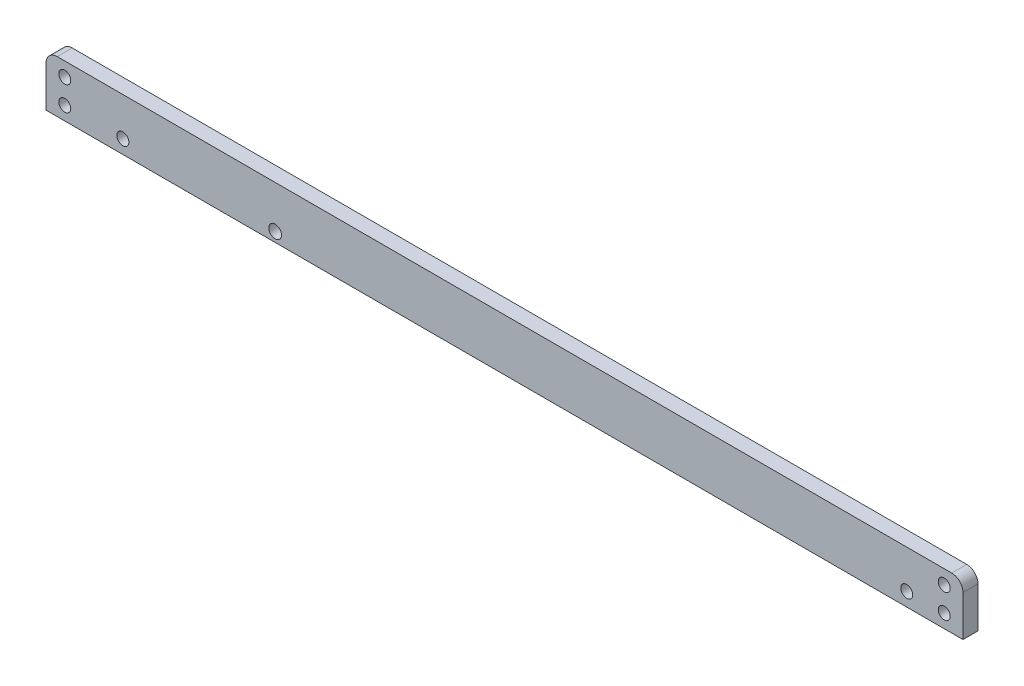
ISO-10303-21;
HEADER;
FILE_DESCRIPTION(('STEP AP214'),'2;1');
FILE_NAME('part.step','',(''),(''),'','','');
FILE_SCHEMA(('AUTOMOTIVE_DESIGN { 1 0 10303 214 1 1 1 1 }'));
ENDSEC;
DATA;
#1=APPLICATION_CONTEXT('core data for automotive mechanical design processes');
#2=APPLICATION_PROTOCOL_DEFINITION('international standard','automotive_design',2000,#1);
#3=PRODUCT_CONTEXT('',#1,'mechanical');
#4=PRODUCT('Part','Part','',(#3));
#5=PRODUCT_RELATED_PRODUCT_CATEGORY('part','',(#4));
#6=PRODUCT_DEFINITION_FORMATION('','',#4);
#7=PRODUCT_DEFINITION_CONTEXT('part definition',#1,'design');
#8=PRODUCT_DEFINITION('design','',#6,#7);
#9=PRODUCT_DEFINITION_SHAPE('','',#8);
#10=(LENGTH_UNIT() NAMED_UNIT(*) SI_UNIT(.MILLI.,.METRE.));
#11=(NAMED_UNIT(*) PLANE_ANGLE_UNIT() SI_UNIT($,.RADIAN.));
#12=(NAMED_UNIT(*) SI_UNIT($,.STERADIAN.) SOLID_ANGLE_UNIT());
#13=UNCERTAINTY_MEASURE_WITH_UNIT(LENGTH_MEASURE(1.E-05),#10,'distance_accuracy_value','');
#14=(GEOMETRIC_REPRESENTATION_CONTEXT(3) GLOBAL_UNCERTAINTY_ASSIGNED_CONTEXT((#13)) GLOBAL_UNIT_ASSIGNED_CONTEXT((#10,
#11,#12)) REPRESENTATION_CONTEXT('',''));
#15=CARTESIAN_POINT('',(0.,0.,0.));
#16=DIRECTION('',(0.,0.,1.));
#17=DIRECTION('',(1.,0.,0.));
#18=AXIS2_PLACEMENT_3D('',#15,#16,#17);
#19=CARTESIAN_POINT('',(59.5710686986753,86.4050911707322,4.));
#20=DIRECTION('',(0.,0.,-1.));
#21=DIRECTION('',(-1.,0.,0.));
#22=AXIS2_PLACEMENT_3D('',#19,#20,#21);
#23=CYLINDRICAL_SURFACE('',#22,3.);
#24=CARTESIAN_POINT('',(59.5710686986753,86.4050911707322,0.));
#25=DIRECTION('',(0.,0.,1.));
#26=DIRECTION('',(1.,0.,0.));
#27=AXIS2_PLACEMENT_3D('',#24,#25,#26);
#28=CIRCLE('',#27,3.);
#29=CARTESIAN_POINT('',(62.5710686986753,86.4050911707322,0.));
#30=VERTEX_POINT('',#29);
#31=CARTESIAN_POINT('',(59.5710686986753,89.4050911707322,0.));
#32=VERTEX_POINT('',#31);
#33=EDGE_CURVE('E116',#30,#32,#28,.T.);
#34=ORIENTED_EDGE('',*,*,#33,.T.);
#35=DIRECTION('',(0.,0.,-1.));
#36=VECTOR('',#35,1.);
#37=CARTESIAN_POINT('',(59.5710686986753,89.4050911707322,4.));
#38=LINE('',#37,#36);
#39=CARTESIAN_POINT('',(59.5710686986753,89.4050911707322,4.));
#40=VERTEX_POINT('',#39);
#41=EDGE_CURVE('E11',#40,#32,#38,.T.);
#42=ORIENTED_EDGE('',*,*,#41,.F.);
#43=CARTESIAN_POINT('',(59.5710686986753,86.4050911707322,4.));
#44=DIRECTION('',(0.,0.,1.));
#45=DIRECTION('',(1.,0.,0.));
#46=AXIS2_PLACEMENT_3D('',#43,#44,#45);
#47=CIRCLE('',#46,3.);
#48=CARTESIAN_POINT('',(62.5710686986753,86.4050911707322,4.));
#49=VERTEX_POINT('',#48);
#50=EDGE_CURVE('E127',#49,#40,#47,.T.);
#51=ORIENTED_EDGE('',*,*,#50,.F.);
#52=DIRECTION('',(0.,0.,-1.));
#53=VECTOR('',#52,1.);
#54=CARTESIAN_POINT('',(62.5710686986753,86.4050911707322,4.));
#55=LINE('',#54,#53);
#56=EDGE_CURVE('E112',#49,#30,#55,.T.);
#57=ORIENTED_EDGE('',*,*,#56,.T.);
#58=EDGE_LOOP('',(#34,#42,#51,#57));
#59=FACE_BOUND('',#58,.T.);
#60=ADVANCED_FACE('F32',(#59),#23,.T.);
#61=CARTESIAN_POINT('',(59.5710686986753,89.4050911707322,4.));
#62=DIRECTION('',(0.,-1.,0.));
#63=DIRECTION('',(1.,0.,0.));
#64=AXIS2_PLACEMENT_3D('',#61,#62,#63);
#65=PLANE('',#64);
#66=DIRECTION('',(-1.,0.,0.));
#67=VECTOR('',#66,1.);
#68=CARTESIAN_POINT('',(59.5710686986753,89.4050911707322,0.));
#69=LINE('',#68,#67);
#70=CARTESIAN_POINT('',(-178.928931301324,89.4050911707322,0.));
#71=VERTEX_POINT('',#70);
#72=EDGE_CURVE('E119',#32,#71,#69,.T.);
#73=ORIENTED_EDGE('',*,*,#72,.T.);
#74=DIRECTION('',(0.,0.,-1.));
#75=VECTOR('',#74,1.);
#76=CARTESIAN_POINT('',(-178.928931301324,89.4050911707322,4.));
#77=LINE('',#76,#75);
#78=CARTESIAN_POINT('',(-178.928931301324,89.4050911707322,4.));
#79=VERTEX_POINT('',#78);
#80=EDGE_CURVE('E40',#79,#71,#77,.T.);
#81=ORIENTED_EDGE('',*,*,#80,.F.);
#82=DIRECTION('',(-1.,0.,0.));
#83=VECTOR('',#82,1.);
#84=CARTESIAN_POINT('',(59.5710686986753,89.4050911707322,4.));
#85=LINE('',#84,#83);
#86=EDGE_CURVE('E85',#40,#79,#85,.T.);
#87=ORIENTED_EDGE('',*,*,#86,.F.);
#88=ORIENTED_EDGE('',*,*,#41,.T.);
#89=EDGE_LOOP('',(#73,#81,#87,#88));
#90=FACE_BOUND('',#89,.T.);
#91=ADVANCED_FACE('F152',(#90),#65,.F.);
#92=CARTESIAN_POINT('',(-178.928931301324,86.4050911707322,4.));
#93=DIRECTION('',(0.,0.,-1.));
#94=DIRECTION('',(-1.,0.,0.));
#95=AXIS2_PLACEMENT_3D('',#92,#93,#94);
#96=CYLINDRICAL_SURFACE('',#95,3.);
#97=CARTESIAN_POINT('',(-178.928931301324,86.4050911707322,0.));
#98=DIRECTION('',(0.,0.,1.));
#99=DIRECTION('',(1.,0.,0.));
#100=AXIS2_PLACEMENT_3D('',#97,#98,#99);
#101=CIRCLE('',#100,3.);
#102=CARTESIAN_POINT('',(-181.928931301324,86.4050911707322,0.));
#103=VERTEX_POINT('',#102);
#104=EDGE_CURVE('E122',#71,#103,#101,.T.);
#105=ORIENTED_EDGE('',*,*,#104,.T.);
#106=DIRECTION('',(0.,0.,-1.));
#107=VECTOR('',#106,1.);
#108=CARTESIAN_POINT('',(-181.928931301324,86.4050911707322,4.));
#109=LINE('',#108,#107);
#110=CARTESIAN_POINT('',(-181.928931301324,86.4050911707322,4.));
#111=VERTEX_POINT('',#110);
#112=EDGE_CURVE('E107',#111,#103,#109,.T.);
#113=ORIENTED_EDGE('',*,*,#112,.F.);
#114=CARTESIAN_POINT('',(-178.928931301324,86.4050911707322,4.));
#115=DIRECTION('',(0.,0.,1.));
#116=DIRECTION('',(1.,0.,0.));
#117=AXIS2_PLACEMENT_3D('',#114,#115,#116);
#118=CIRCLE('',#117,3.);
#119=EDGE_CURVE('E98',#79,#111,#118,.T.);
#120=ORIENTED_EDGE('',*,*,#119,.F.);
#121=ORIENTED_EDGE('',*,*,#80,.T.);
#122=EDGE_LOOP('',(#105,#113,#120,#121));
#123=FACE_BOUND('',#122,.T.);
#124=ADVANCED_FACE('F133',(#123),#96,.T.);
#125=CARTESIAN_POINT('',(-181.928931301324,86.4050911707322,4.));
#126=DIRECTION('',(1.,0.,0.));
#127=DIRECTION('',(0.,1.,0.));
#128=AXIS2_PLACEMENT_3D('',#125,#126,#127);
#129=PLANE('',#128);
#130=DIRECTION('',(0.,-1.,0.));
#131=VECTOR('',#130,1.);
#132=CARTESIAN_POINT('',(-181.928931301324,86.4050911707322,0.));
#133=LINE('',#132,#131);
#134=CARTESIAN_POINT('',(-181.928931301324,75.5392616190504,0.));
#135=VERTEX_POINT('',#134);
#136=EDGE_CURVE('E106',#103,#135,#133,.T.);
#137=ORIENTED_EDGE('',*,*,#136,.T.);
#138=DIRECTION('',(0.,0.,-1.));
#139=VECTOR('',#138,1.);
#140=CARTESIAN_POINT('',(-181.928931301324,75.5392616190504,4.));
#141=LINE('',#140,#139);
#142=CARTESIAN_POINT('',(-181.928931301324,75.5392616190504,4.));
#143=VERTEX_POINT('',#142);
#144=EDGE_CURVE('E103',#143,#135,#141,.T.);
#145=ORIENTED_EDGE('',*,*,#144,.F.);
#146=DIRECTION('',(0.,-1.,0.));
#147=VECTOR('',#146,1.);
#148=CARTESIAN_POINT('',(-181.928931301324,86.4050911707322,4.));
#149=LINE('',#148,#147);
#150=EDGE_CURVE('E92',#111,#143,#149,.T.);
#151=ORIENTED_EDGE('',*,*,#150,.F.);
#152=ORIENTED_EDGE('',*,*,#112,.T.);
#153=EDGE_LOOP('',(#137,#145,#151,#152));
#154=FACE_BOUND('',#153,.T.);
#155=ADVANCED_FACE('F104',(#154),#129,.F.);
#156=CARTESIAN_POINT('',(62.5710686986753,75.5392616190504,4.));
#157=DIRECTION('',(0.,1.,0.));
#158=DIRECTION('',(0.,0.,1.));
#159=AXIS2_PLACEMENT_3D('',#156,#157,#158);
#160=PLANE('',#159);
#161=DIRECTION('',(1.,0.,0.));
#162=VECTOR('',#161,1.);
#163=CARTESIAN_POINT('',(62.5710686986753,75.5392616190504,0.));
#164=LINE('',#163,#162);
#165=CARTESIAN_POINT('',(62.5710686986753,75.5392616190504,0.));
#166=VERTEX_POINT('',#165);
#167=EDGE_CURVE('E71',#135,#166,#164,.T.);
#168=ORIENTED_EDGE('',*,*,#167,.T.);
#169=DIRECTION('',(0.,0.,-1.));
#170=VECTOR('',#169,1.);
#171=CARTESIAN_POINT('',(62.5710686986753,75.5392616190504,4.));
#172=LINE('',#171,#170);
#173=CARTESIAN_POINT('',(62.5710686986753,75.5392616190504,4.));
#174=VERTEX_POINT('',#173);
#175=EDGE_CURVE('E108',#174,#166,#172,.T.);
#176=ORIENTED_EDGE('',*,*,#175,.F.);
#177=DIRECTION('',(1.,0.,0.));
#178=VECTOR('',#177,1.);
#179=CARTESIAN_POINT('',(62.5710686986753,75.5392616190504,4.));
#180=LINE('',#179,#178);
#181=EDGE_CURVE('E96',#143,#174,#180,.T.);
#182=ORIENTED_EDGE('',*,*,#181,.F.);
#183=ORIENTED_EDGE('',*,*,#144,.T.);
#184=EDGE_LOOP('',(#168,#176,#182,#183));
#185=FACE_BOUND('',#184,.T.);
#186=ADVANCED_FACE('F110',(#185),#160,.F.);
#187=CARTESIAN_POINT('',(62.5710686986753,75.5392616190504,4.));
#188=DIRECTION('',(-1.,0.,0.));
#189=DIRECTION('',(0.,0.,1.));
#190=AXIS2_PLACEMENT_3D('',#187,#188,#189);
#191=PLANE('',#190);
#192=DIRECTION('',(0.,1.,0.));
#193=VECTOR('',#192,1.);
#194=CARTESIAN_POINT('',(62.5710686986753,75.5392616190504,0.));
#195=LINE('',#194,#193);
#196=EDGE_CURVE('E77',#166,#30,#195,.T.);
#197=ORIENTED_EDGE('',*,*,#196,.T.);
#198=ORIENTED_EDGE('',*,*,#56,.F.);
#199=DIRECTION('',(0.,1.,0.));
#200=VECTOR('',#199,1.);
#201=CARTESIAN_POINT('',(62.5710686986753,75.5392616190504,4.));
#202=LINE('',#201,#200);
#203=EDGE_CURVE('E48',#174,#49,#202,.T.);
#204=ORIENTED_EDGE('',*,*,#203,.F.);
#205=ORIENTED_EDGE('',*,*,#175,.T.);
#206=EDGE_LOOP('',(#197,#198,#204,#205));
#207=FACE_BOUND('',#206,.T.);
#208=ADVANCED_FACE('F140',(#207),#191,.F.);
#209=CARTESIAN_POINT('',(59.5710686986753,86.4050911707322,4.));
#210=DIRECTION('',(0.,0.,1.));
#211=DIRECTION('',(1.,0.,0.));
#212=AXIS2_PLACEMENT_3D('',#209,#210,#211);
#213=PLANE('',#212);
#214=CARTESIAN_POINT('',(-120.832295199773,78.0750911707318,4.));
#215=DIRECTION('',(0.,0.,-1.));
#216=DIRECTION('',(-1.,0.,0.));
#217=AXIS2_PLACEMENT_3D('',#214,#215,#216);
#218=CIRCLE('',#217,1.69999999999999);
#219=CARTESIAN_POINT('',(-122.532295199773,78.0750911707318,4.));
#220=VERTEX_POINT('',#219);
#221=EDGE_CURVE('E265',#220,#220,#218,.T.);
#222=ORIENTED_EDGE('',*,*,#221,.T.);
#223=EDGE_LOOP('',(#222));
#224=FACE_BOUND('',#223,.T.);
#225=CARTESIAN_POINT('',(-176.928931301324,85.6728411707414,4.));
#226=DIRECTION('',(0.,0.,1.));
#227=DIRECTION('',(1.,0.,0.));
#228=AXIS2_PLACEMENT_3D('',#225,#226,#227);
#229=CIRCLE('',#228,1.59999999999999);
#230=CARTESIAN_POINT('',(-175.328931301324,85.6728411707414,4.));
#231=VERTEX_POINT('',#230);
#232=EDGE_CURVE('E270',#231,#231,#229,.T.);
#233=ORIENTED_EDGE('',*,*,#232,.F.);
#234=EDGE_LOOP('',(#233));
#235=FACE_BOUND('',#234,.T.);
#236=CARTESIAN_POINT('',(-176.928931301324,79.1728411707414,4.));
#237=DIRECTION('',(0.,0.,1.));
#238=DIRECTION('',(1.,0.,0.));
#239=AXIS2_PLACEMENT_3D('',#236,#237,#238);
#240=CIRCLE('',#239,1.59999999999999);
#241=CARTESIAN_POINT('',(-175.328931301324,79.1728411707414,4.));
#242=VERTEX_POINT('',#241);
#243=EDGE_CURVE('E278',#242,#242,#240,.T.);
#244=ORIENTED_EDGE('',*,*,#243,.F.);
#245=EDGE_LOOP('',(#244));
#246=FACE_BOUND('',#245,.T.);
#247=CARTESIAN_POINT('',(-161.428931301324,79.1728411707414,4.));
#248=DIRECTION('',(0.,0.,1.));
#249=DIRECTION('',(1.,0.,0.));
#250=AXIS2_PLACEMENT_3D('',#247,#248,#249);
#251=CIRCLE('',#250,1.59999999999999);
#252=CARTESIAN_POINT('',(-159.828931301324,79.1728411707414,4.));
#253=VERTEX_POINT('',#252);
#254=EDGE_CURVE('E284',#253,#253,#251,.T.);
#255=ORIENTED_EDGE('',*,*,#254,.F.);
#256=EDGE_LOOP('',(#255));
#257=FACE_BOUND('',#256,.T.);
#258=CARTESIAN_POINT('',(47.5710686986759,79.1728411707414,4.));
#259=DIRECTION('',(0.,0.,1.));
#260=DIRECTION('',(1.,0.,0.));
#261=AXIS2_PLACEMENT_3D('',#258,#259,#260);
#262=CIRCLE('',#261,1.59999999999999);
#263=CARTESIAN_POINT('',(49.1710686986759,79.1728411707414,4.));
#264=VERTEX_POINT('',#263);
#265=EDGE_CURVE('E290',#264,#264,#262,.T.);
#266=ORIENTED_EDGE('',*,*,#265,.F.);
#267=EDGE_LOOP('',(#266));
#268=FACE_BOUND('',#267,.T.);
#269=CARTESIAN_POINT('',(57.5710686986753,79.1728411707414,4.));
#270=DIRECTION('',(0.,0.,1.));
#271=DIRECTION('',(1.,0.,0.));
#272=AXIS2_PLACEMENT_3D('',#269,#270,#271);
#273=CIRCLE('',#272,1.59999999999999);
#274=CARTESIAN_POINT('',(59.1710686986753,79.1728411707414,4.));
#275=VERTEX_POINT('',#274);
#276=EDGE_CURVE('E296',#275,#275,#273,.T.);
#277=ORIENTED_EDGE('',*,*,#276,.F.);
#278=EDGE_LOOP('',(#277));
#279=FACE_BOUND('',#278,.T.);
#280=CARTESIAN_POINT('',(57.5710686986753,85.6728411707414,4.));
#281=DIRECTION('',(0.,0.,1.));
#282=DIRECTION('',(1.,0.,0.));
#283=AXIS2_PLACEMENT_3D('',#280,#281,#282);
#284=CIRCLE('',#283,1.59999999999999);
#285=CARTESIAN_POINT('',(59.1710686986753,85.6728411707414,4.));
#286=VERTEX_POINT('',#285);
#287=EDGE_CURVE('E302',#286,#286,#284,.T.);
#288=ORIENTED_EDGE('',*,*,#287,.F.);
#289=EDGE_LOOP('',(#288));
#290=FACE_BOUND('',#289,.T.);
#291=ORIENTED_EDGE('',*,*,#50,.T.);
#292=ORIENTED_EDGE('',*,*,#86,.T.);
#293=ORIENTED_EDGE('',*,*,#119,.T.);
#294=ORIENTED_EDGE('',*,*,#150,.T.);
#295=ORIENTED_EDGE('',*,*,#181,.T.);
#296=ORIENTED_EDGE('',*,*,#203,.T.);
#297=EDGE_LOOP('',(#291,#292,#293,#294,#295,#296));
#298=FACE_BOUND('',#297,.T.);
#299=ADVANCED_FACE('F94',(#224,#235,#246,#257,#268,#279,#290,#298),#213,.T.);
#300=CARTESIAN_POINT('',(59.5710686986753,86.4050911707322,0.));
#301=DIRECTION('',(0.,0.,1.));
#302=DIRECTION('',(1.,0.,0.));
#303=AXIS2_PLACEMENT_3D('',#300,#301,#302);
#304=PLANE('',#303);
#305=CARTESIAN_POINT('',(-120.832295199773,78.0750911707318,0.));
#306=DIRECTION('',(0.,0.,-1.));
#307=DIRECTION('',(-1.,0.,0.));
#308=AXIS2_PLACEMENT_3D('',#305,#306,#307);
#309=CIRCLE('',#308,1.69999999999999);
#310=CARTESIAN_POINT('',(-122.532295199773,78.0750911707318,0.));
#311=VERTEX_POINT('',#310);
#312=EDGE_CURVE('E268',#311,#311,#309,.T.);
#313=ORIENTED_EDGE('',*,*,#312,.F.);
#314=EDGE_LOOP('',(#313));
#315=FACE_BOUND('',#314,.T.);
#316=CARTESIAN_POINT('',(-176.928931301324,85.6728411707414,0.));
#317=DIRECTION('',(0.,0.,1.));
#318=DIRECTION('',(1.,0.,0.));
#319=AXIS2_PLACEMENT_3D('',#316,#317,#318);
#320=CIRCLE('',#319,1.59999999999999);
#321=CARTESIAN_POINT('',(-175.328931301324,85.6728411707414,0.));
#322=VERTEX_POINT('',#321);
#323=EDGE_CURVE('E275',#322,#322,#320,.T.);
#324=ORIENTED_EDGE('',*,*,#323,.T.);
#325=EDGE_LOOP('',(#324));
#326=FACE_BOUND('',#325,.T.);
#327=CARTESIAN_POINT('',(-176.928931301324,79.1728411707414,0.));
#328=DIRECTION('',(0.,0.,1.));
#329=DIRECTION('',(1.,0.,0.));
#330=AXIS2_PLACEMENT_3D('',#327,#328,#329);
#331=CIRCLE('',#330,1.59999999999999);
#332=CARTESIAN_POINT('',(-175.328931301324,79.1728411707414,0.));
#333=VERTEX_POINT('',#332);
#334=EDGE_CURVE('E281',#333,#333,#331,.T.);
#335=ORIENTED_EDGE('',*,*,#334,.T.);
#336=EDGE_LOOP('',(#335));
#337=FACE_BOUND('',#336,.T.);
#338=CARTESIAN_POINT('',(-161.428931301324,79.1728411707414,0.));
#339=DIRECTION('',(0.,0.,1.));
#340=DIRECTION('',(1.,0.,0.));
#341=AXIS2_PLACEMENT_3D('',#338,#339,#340);
#342=CIRCLE('',#341,1.59999999999999);
#343=CARTESIAN_POINT('',(-159.828931301324,79.1728411707414,0.));
#344=VERTEX_POINT('',#343);
#345=EDGE_CURVE('E287',#344,#344,#342,.T.);
#346=ORIENTED_EDGE('',*,*,#345,.T.);
#347=EDGE_LOOP('',(#346));
#348=FACE_BOUND('',#347,.T.);
#349=CARTESIAN_POINT('',(47.5710686986759,79.1728411707414,0.));
#350=DIRECTION('',(0.,0.,1.));
#351=DIRECTION('',(1.,0.,0.));
#352=AXIS2_PLACEMENT_3D('',#349,#350,#351);
#353=CIRCLE('',#352,1.59999999999999);
#354=CARTESIAN_POINT('',(49.1710686986759,79.1728411707414,0.));
#355=VERTEX_POINT('',#354);
#356=EDGE_CURVE('E293',#355,#355,#353,.T.);
#357=ORIENTED_EDGE('',*,*,#356,.T.);
#358=EDGE_LOOP('',(#357));
#359=FACE_BOUND('',#358,.T.);
#360=CARTESIAN_POINT('',(57.5710686986753,79.1728411707414,0.));
#361=DIRECTION('',(0.,0.,1.));
#362=DIRECTION('',(1.,0.,0.));
#363=AXIS2_PLACEMENT_3D('',#360,#361,#362);
#364=CIRCLE('',#363,1.59999999999999);
#365=CARTESIAN_POINT('',(59.1710686986753,79.1728411707414,0.));
#366=VERTEX_POINT('',#365);
#367=EDGE_CURVE('E299',#366,#366,#364,.T.);
#368=ORIENTED_EDGE('',*,*,#367,.T.);
#369=EDGE_LOOP('',(#368));
#370=FACE_BOUND('',#369,.T.);
#371=CARTESIAN_POINT('',(57.5710686986753,85.6728411707414,0.));
#372=DIRECTION('',(0.,0.,1.));
#373=DIRECTION('',(1.,0.,0.));
#374=AXIS2_PLACEMENT_3D('',#371,#372,#373);
#375=CIRCLE('',#374,1.59999999999999);
#376=CARTESIAN_POINT('',(59.1710686986753,85.6728411707414,0.));
#377=VERTEX_POINT('',#376);
#378=EDGE_CURVE('E120',#377,#377,#375,.T.);
#379=ORIENTED_EDGE('',*,*,#378,.T.);
#380=EDGE_LOOP('',(#379));
#381=FACE_BOUND('',#380,.T.);
#382=ORIENTED_EDGE('',*,*,#33,.F.);
#383=ORIENTED_EDGE('',*,*,#196,.F.);
#384=ORIENTED_EDGE('',*,*,#167,.F.);
#385=ORIENTED_EDGE('',*,*,#136,.F.);
#386=ORIENTED_EDGE('',*,*,#104,.F.);
#387=ORIENTED_EDGE('',*,*,#72,.F.);
#388=EDGE_LOOP('',(#382,#383,#384,#385,#386,#387));
#389=FACE_BOUND('',#388,.T.);
#390=ADVANCED_FACE('F136',(#315,#326,#337,#348,#359,#370,#381,#389),#304,.F.);
#391=CARTESIAN_POINT('',(57.5710686986753,85.6728411707414,4.));
#392=DIRECTION('',(0.,0.,1.));
#393=DIRECTION('',(1.,0.,0.));
#394=AXIS2_PLACEMENT_3D('',#391,#392,#393);
#395=CYLINDRICAL_SURFACE('',#394,1.59999999999999);
#396=ORIENTED_EDGE('',*,*,#378,.F.);
#397=EDGE_LOOP('',(#396));
#398=FACE_BOUND('',#397,.T.);
#399=ORIENTED_EDGE('',*,*,#287,.T.);
#400=EDGE_LOOP('',(#399));
#401=FACE_BOUND('',#400,.T.);
#402=ADVANCED_FACE('F180',(#398,#401),#395,.F.);
#403=CARTESIAN_POINT('',(57.5710686986753,79.1728411707414,4.));
#404=DIRECTION('',(0.,0.,1.));
#405=DIRECTION('',(1.,0.,0.));
#406=AXIS2_PLACEMENT_3D('',#403,#404,#405);
#407=CYLINDRICAL_SURFACE('',#406,1.59999999999999);
#408=ORIENTED_EDGE('',*,*,#367,.F.);
#409=EDGE_LOOP('',(#408));
#410=FACE_BOUND('',#409,.T.);
#411=ORIENTED_EDGE('',*,*,#276,.T.);
#412=EDGE_LOOP('',(#411));
#413=FACE_BOUND('',#412,.T.);
#414=ADVANCED_FACE('F185',(#410,#413),#407,.F.);
#415=CARTESIAN_POINT('',(47.5710686986759,79.1728411707414,4.));
#416=DIRECTION('',(0.,0.,1.));
#417=DIRECTION('',(1.,0.,0.));
#418=AXIS2_PLACEMENT_3D('',#415,#416,#417);
#419=CYLINDRICAL_SURFACE('',#418,1.59999999999999);
#420=ORIENTED_EDGE('',*,*,#356,.F.);
#421=EDGE_LOOP('',(#420));
#422=FACE_BOUND('',#421,.T.);
#423=ORIENTED_EDGE('',*,*,#265,.T.);
#424=EDGE_LOOP('',(#423));
#425=FACE_BOUND('',#424,.T.);
#426=ADVANCED_FACE('F197',(#422,#425),#419,.F.);
#427=CARTESIAN_POINT('',(-161.428931301324,79.1728411707414,4.));
#428=DIRECTION('',(0.,0.,1.));
#429=DIRECTION('',(1.,0.,0.));
#430=AXIS2_PLACEMENT_3D('',#427,#428,#429);
#431=CYLINDRICAL_SURFACE('',#430,1.59999999999999);
#432=ORIENTED_EDGE('',*,*,#345,.F.);
#433=EDGE_LOOP('',(#432));
#434=FACE_BOUND('',#433,.T.);
#435=ORIENTED_EDGE('',*,*,#254,.T.);
#436=EDGE_LOOP('',(#435));
#437=FACE_BOUND('',#436,.T.);
#438=ADVANCED_FACE('F207',(#434,#437),#431,.F.);
#439=CARTESIAN_POINT('',(-176.928931301324,79.1728411707414,4.));
#440=DIRECTION('',(0.,0.,1.));
#441=DIRECTION('',(1.,0.,0.));
#442=AXIS2_PLACEMENT_3D('',#439,#440,#441);
#443=CYLINDRICAL_SURFACE('',#442,1.59999999999999);
#444=ORIENTED_EDGE('',*,*,#334,.F.);
#445=EDGE_LOOP('',(#444));
#446=FACE_BOUND('',#445,.T.);
#447=ORIENTED_EDGE('',*,*,#243,.T.);
#448=EDGE_LOOP('',(#447));
#449=FACE_BOUND('',#448,.T.);
#450=ADVANCED_FACE('F217',(#446,#449),#443,.F.);
#451=CARTESIAN_POINT('',(-176.928931301324,85.6728411707414,4.));
#452=DIRECTION('',(0.,0.,1.));
#453=DIRECTION('',(1.,0.,0.));
#454=AXIS2_PLACEMENT_3D('',#451,#452,#453);
#455=CYLINDRICAL_SURFACE('',#454,1.59999999999999);
#456=ORIENTED_EDGE('',*,*,#323,.F.);
#457=EDGE_LOOP('',(#456));
#458=FACE_BOUND('',#457,.T.);
#459=ORIENTED_EDGE('',*,*,#232,.T.);
#460=EDGE_LOOP('',(#459));
#461=FACE_BOUND('',#460,.T.);
#462=ADVANCED_FACE('F227',(#458,#461),#455,.F.);
#463=CARTESIAN_POINT('',(-120.832295199773,78.0750911707318,0.));
#464=DIRECTION('',(0.,0.,-1.));
#465=DIRECTION('',(-1.,0.,0.));
#466=AXIS2_PLACEMENT_3D('',#463,#464,#465);
#467=CYLINDRICAL_SURFACE('',#466,1.69999999999999);
#468=ORIENTED_EDGE('',*,*,#221,.F.);
#469=EDGE_LOOP('',(#468));
#470=FACE_BOUND('',#469,.T.);
#471=ORIENTED_EDGE('',*,*,#312,.T.);
#472=EDGE_LOOP('',(#471));
#473=FACE_BOUND('',#472,.T.);
#474=ADVANCED_FACE('F237',(#470,#473),#467,.F.);
#475=CLOSED_SHELL('',(#60,#91,#124,#155,#186,#208,#299,#390,#402,#414,#426,#438,#450,#462,#474));
#476=MANIFOLD_SOLID_BREP('B2',#475);
#477=ADVANCED_BREP_SHAPE_REPRESENTATION('',(#18,#476),#14);
#478=SHAPE_DEFINITION_REPRESENTATION(#9,#477);
ENDSEC;
END-ISO-10303-21;
